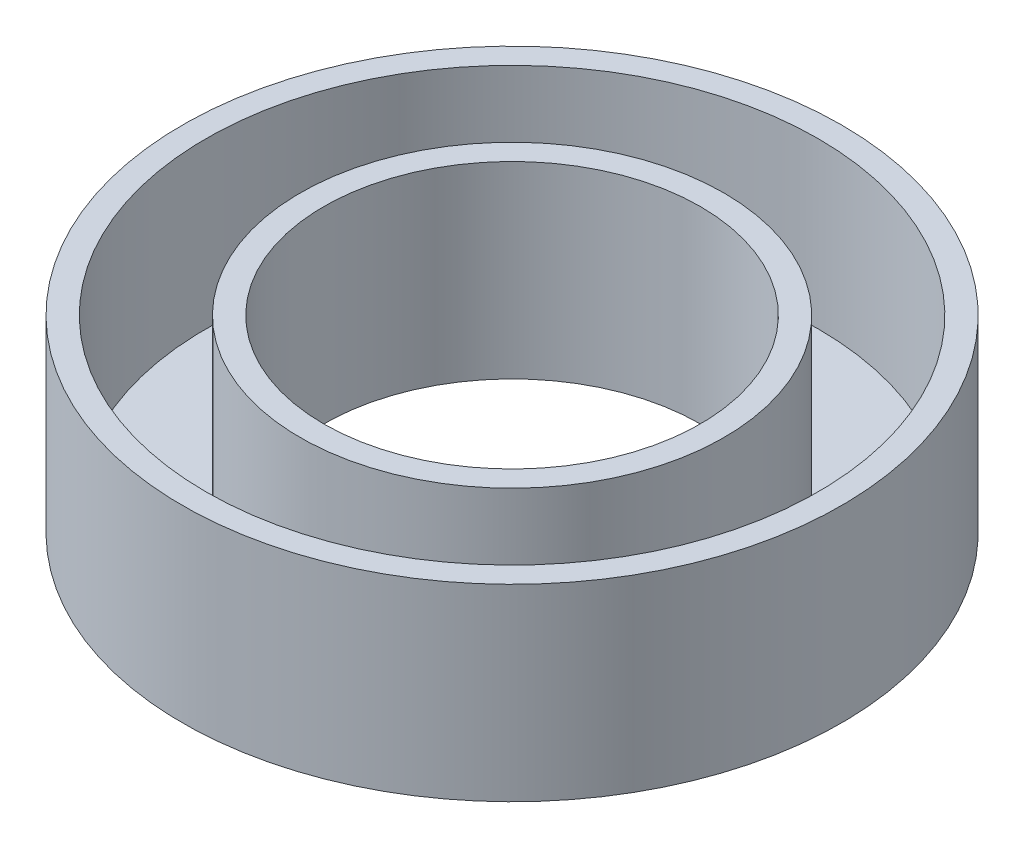
ISO-10303-21;
HEADER;
FILE_DESCRIPTION(('STEP AP214'),'2;1');
FILE_NAME('part.step','',(''),(''),'','','');
FILE_SCHEMA(('AUTOMOTIVE_DESIGN { 1 0 10303 214 1 1 1 1 }'));
ENDSEC;
DATA;
#1=APPLICATION_CONTEXT('core data for automotive mechanical design processes');
#2=APPLICATION_PROTOCOL_DEFINITION('international standard','automotive_design',2000,#1);
#3=PRODUCT_CONTEXT('',#1,'mechanical');
#4=PRODUCT('Part','Part','',(#3));
#5=PRODUCT_RELATED_PRODUCT_CATEGORY('part','',(#4));
#6=PRODUCT_DEFINITION_FORMATION('','',#4);
#7=PRODUCT_DEFINITION_CONTEXT('part definition',#1,'design');
#8=PRODUCT_DEFINITION('design','',#6,#7);
#9=PRODUCT_DEFINITION_SHAPE('','',#8);
#10=(LENGTH_UNIT() NAMED_UNIT(*) SI_UNIT(.MILLI.,.METRE.));
#11=(NAMED_UNIT(*) PLANE_ANGLE_UNIT() SI_UNIT($,.RADIAN.));
#12=(NAMED_UNIT(*) SI_UNIT($,.STERADIAN.) SOLID_ANGLE_UNIT());
#13=UNCERTAINTY_MEASURE_WITH_UNIT(LENGTH_MEASURE(1.E-05),#10,'distance_accuracy_value','');
#14=(GEOMETRIC_REPRESENTATION_CONTEXT(3) GLOBAL_UNCERTAINTY_ASSIGNED_CONTEXT((#13)) GLOBAL_UNIT_ASSIGNED_CONTEXT((#10,
#11,#12)) REPRESENTATION_CONTEXT('',''));
#15=CARTESIAN_POINT('',(0.,0.,0.));
#16=DIRECTION('',(0.,0.,1.));
#17=DIRECTION('',(1.,0.,0.));
#18=AXIS2_PLACEMENT_3D('',#15,#16,#17);
#19=CARTESIAN_POINT('',(-10.31875,6.35,0.));
#20=DIRECTION('',(0.,-1.,0.));
#21=DIRECTION('',(0.,0.,-1.));
#22=AXIS2_PLACEMENT_3D('',#19,#20,#21);
#23=PLANE('',#22);
#24=CARTESIAN_POINT('',(0.,6.35,0.));
#25=DIRECTION('',(0.,-1.,0.));
#26=DIRECTION('',(0.,0.,-1.));
#27=AXIS2_PLACEMENT_3D('',#24,#25,#26);
#28=CIRCLE('',#27,11.1125);
#29=CARTESIAN_POINT('',(0.,6.35,-11.1125));
#30=VERTEX_POINT('',#29);
#31=EDGE_CURVE('E10',#30,#30,#28,.T.);
#32=ORIENTED_EDGE('',*,*,#31,.F.);
#33=EDGE_LOOP('',(#32));
#34=FACE_BOUND('',#33,.T.);
#35=CARTESIAN_POINT('',(0.,6.35,0.));
#36=DIRECTION('',(0.,-1.,0.));
#37=DIRECTION('',(0.,0.,-1.));
#38=AXIS2_PLACEMENT_3D('',#35,#36,#37);
#39=CIRCLE('',#38,10.31875);
#40=CARTESIAN_POINT('',(0.,6.35,-10.31875));
#41=VERTEX_POINT('',#40);
#42=EDGE_CURVE('E59',#41,#41,#39,.T.);
#43=ORIENTED_EDGE('',*,*,#42,.T.);
#44=EDGE_LOOP('',(#43));
#45=FACE_BOUND('',#44,.T.);
#46=ADVANCED_FACE('F31',(#34,#45),#23,.F.);
#47=CARTESIAN_POINT('',(0.,0.,0.));
#48=DIRECTION('',(0.,-1.,0.));
#49=DIRECTION('',(0.,0.,-1.));
#50=AXIS2_PLACEMENT_3D('',#47,#48,#49);
#51=CYLINDRICAL_SURFACE('',#50,11.1125);
#52=CARTESIAN_POINT('',(0.,0.,0.));
#53=DIRECTION('',(0.,-1.,0.));
#54=DIRECTION('',(0.,0.,-1.));
#55=AXIS2_PLACEMENT_3D('',#52,#53,#54);
#56=CIRCLE('',#55,11.1125);
#57=CARTESIAN_POINT('',(0.,0.,-11.1125));
#58=VERTEX_POINT('',#57);
#59=EDGE_CURVE('E37',#58,#58,#56,.T.);
#60=ORIENTED_EDGE('',*,*,#59,.F.);
#61=EDGE_LOOP('',(#60));
#62=FACE_BOUND('',#61,.T.);
#63=ORIENTED_EDGE('',*,*,#31,.T.);
#64=EDGE_LOOP('',(#63));
#65=FACE_BOUND('',#64,.T.);
#66=ADVANCED_FACE('F96',(#62,#65),#51,.T.);
#67=CARTESIAN_POINT('',(-11.1125,0.,0.));
#68=DIRECTION('',(0.,1.,0.));
#69=DIRECTION('',(0.,0.,1.));
#70=AXIS2_PLACEMENT_3D('',#67,#68,#69);
#71=PLANE('',#70);
#72=CARTESIAN_POINT('',(0.,0.,0.));
#73=DIRECTION('',(0.,-1.,0.));
#74=DIRECTION('',(0.,0.,-1.));
#75=AXIS2_PLACEMENT_3D('',#72,#73,#74);
#76=CIRCLE('',#75,6.35);
#77=CARTESIAN_POINT('',(0.,0.,-6.35));
#78=VERTEX_POINT('',#77);
#79=EDGE_CURVE('E41',#78,#78,#76,.T.);
#80=ORIENTED_EDGE('',*,*,#79,.F.);
#81=EDGE_LOOP('',(#80));
#82=FACE_BOUND('',#81,.T.);
#83=ORIENTED_EDGE('',*,*,#59,.T.);
#84=EDGE_LOOP('',(#83));
#85=FACE_BOUND('',#84,.T.);
#86=ADVANCED_FACE('F91',(#82,#85),#71,.F.);
#87=CARTESIAN_POINT('',(0.,0.,0.));
#88=DIRECTION('',(0.,-1.,0.));
#89=DIRECTION('',(0.,0.,-1.));
#90=AXIS2_PLACEMENT_3D('',#87,#88,#89);
#91=CYLINDRICAL_SURFACE('',#90,6.35);
#92=CARTESIAN_POINT('',(0.,6.35,0.));
#93=DIRECTION('',(0.,-1.,0.));
#94=DIRECTION('',(0.,0.,-1.));
#95=AXIS2_PLACEMENT_3D('',#92,#93,#94);
#96=CIRCLE('',#95,6.35);
#97=CARTESIAN_POINT('',(0.,6.35,-6.35));
#98=VERTEX_POINT('',#97);
#99=EDGE_CURVE('E45',#98,#98,#96,.T.);
#100=ORIENTED_EDGE('',*,*,#99,.F.);
#101=EDGE_LOOP('',(#100));
#102=FACE_BOUND('',#101,.T.);
#103=ORIENTED_EDGE('',*,*,#79,.T.);
#104=EDGE_LOOP('',(#103));
#105=FACE_BOUND('',#104,.T.);
#106=ADVANCED_FACE('F85',(#102,#105),#91,.F.);
#107=CARTESIAN_POINT('',(-6.35,6.35,0.));
#108=DIRECTION('',(0.,-1.,0.));
#109=DIRECTION('',(0.,0.,-1.));
#110=AXIS2_PLACEMENT_3D('',#107,#108,#109);
#111=PLANE('',#110);
#112=CARTESIAN_POINT('',(0.,6.35,0.));
#113=DIRECTION('',(0.,-1.,0.));
#114=DIRECTION('',(0.,0.,-1.));
#115=AXIS2_PLACEMENT_3D('',#112,#113,#114);
#116=CIRCLE('',#115,7.14375);
#117=CARTESIAN_POINT('',(0.,6.35,-7.14375));
#118=VERTEX_POINT('',#117);
#119=EDGE_CURVE('E50',#118,#118,#116,.T.);
#120=ORIENTED_EDGE('',*,*,#119,.F.);
#121=EDGE_LOOP('',(#120));
#122=FACE_BOUND('',#121,.T.);
#123=ORIENTED_EDGE('',*,*,#99,.T.);
#124=EDGE_LOOP('',(#123));
#125=FACE_BOUND('',#124,.T.);
#126=ADVANCED_FACE('F79',(#122,#125),#111,.F.);
#127=CARTESIAN_POINT('',(0.,0.,0.));
#128=DIRECTION('',(0.,-1.,0.));
#129=DIRECTION('',(0.,0.,-1.));
#130=AXIS2_PLACEMENT_3D('',#127,#128,#129);
#131=CYLINDRICAL_SURFACE('',#130,7.14375);
#132=CARTESIAN_POINT('',(0.,0.79375,0.));
#133=DIRECTION('',(0.,-1.,0.));
#134=DIRECTION('',(0.,0.,-1.));
#135=AXIS2_PLACEMENT_3D('',#132,#133,#134);
#136=CIRCLE('',#135,7.14375);
#137=CARTESIAN_POINT('',(0.,0.79375,-7.14375));
#138=VERTEX_POINT('',#137);
#139=EDGE_CURVE('E53',#138,#138,#136,.T.);
#140=ORIENTED_EDGE('',*,*,#139,.F.);
#141=EDGE_LOOP('',(#140));
#142=FACE_BOUND('',#141,.T.);
#143=ORIENTED_EDGE('',*,*,#119,.T.);
#144=EDGE_LOOP('',(#143));
#145=FACE_BOUND('',#144,.T.);
#146=ADVANCED_FACE('F73',(#142,#145),#131,.T.);
#147=CARTESIAN_POINT('',(-7.14375,0.79375,0.));
#148=DIRECTION('',(0.,-1.,0.));
#149=DIRECTION('',(0.,0.,-1.));
#150=AXIS2_PLACEMENT_3D('',#147,#148,#149);
#151=PLANE('',#150);
#152=CARTESIAN_POINT('',(0.,0.79375,0.));
#153=DIRECTION('',(0.,-1.,0.));
#154=DIRECTION('',(0.,0.,-1.));
#155=AXIS2_PLACEMENT_3D('',#152,#153,#154);
#156=CIRCLE('',#155,10.31875);
#157=CARTESIAN_POINT('',(0.,0.79375,-10.31875));
#158=VERTEX_POINT('',#157);
#159=EDGE_CURVE('E56',#158,#158,#156,.T.);
#160=ORIENTED_EDGE('',*,*,#159,.F.);
#161=EDGE_LOOP('',(#160));
#162=FACE_BOUND('',#161,.T.);
#163=ORIENTED_EDGE('',*,*,#139,.T.);
#164=EDGE_LOOP('',(#163));
#165=FACE_BOUND('',#164,.T.);
#166=ADVANCED_FACE('F67',(#162,#165),#151,.F.);
#167=CARTESIAN_POINT('',(0.,0.,0.));
#168=DIRECTION('',(0.,-1.,0.));
#169=DIRECTION('',(0.,0.,-1.));
#170=AXIS2_PLACEMENT_3D('',#167,#168,#169);
#171=CYLINDRICAL_SURFACE('',#170,10.31875);
#172=ORIENTED_EDGE('',*,*,#42,.F.);
#173=EDGE_LOOP('',(#172));
#174=FACE_BOUND('',#173,.T.);
#175=ORIENTED_EDGE('',*,*,#159,.T.);
#176=EDGE_LOOP('',(#175));
#177=FACE_BOUND('',#176,.T.);
#178=ADVANCED_FACE('F64',(#174,#177),#171,.F.);
#179=CLOSED_SHELL('',(#46,#66,#86,#106,#126,#146,#166,#178));
#180=MANIFOLD_SOLID_BREP('B2',#179);
#181=ADVANCED_BREP_SHAPE_REPRESENTATION('',(#18,#180),#14);
#182=SHAPE_DEFINITION_REPRESENTATION(#9,#181);
ENDSEC;
END-ISO-10303-21;
